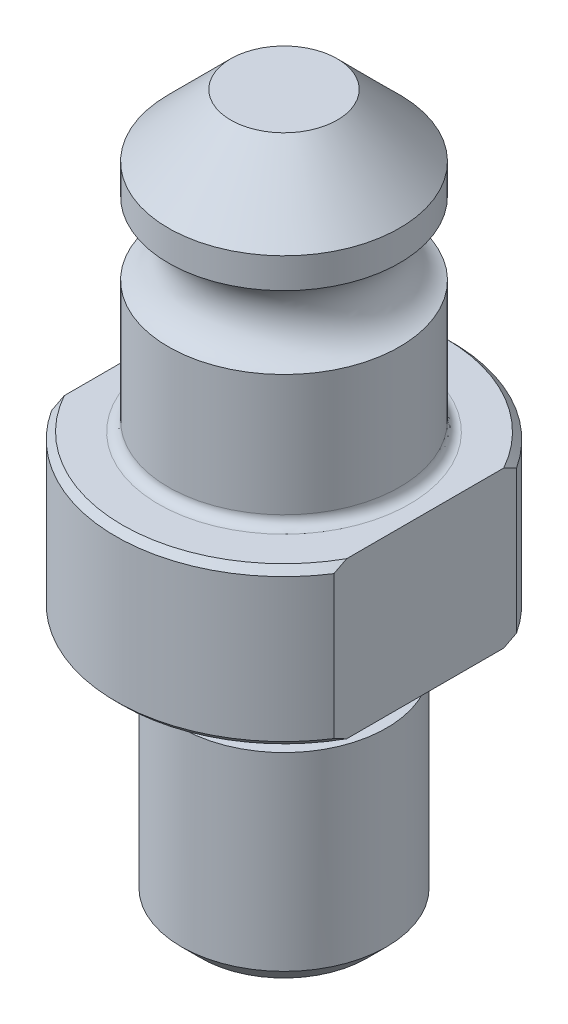
ISO-10303-21;
HEADER;
FILE_DESCRIPTION(('STEP AP214'),'2;1');
FILE_NAME('part.step','',(''),(''),'','','');
FILE_SCHEMA(('AUTOMOTIVE_DESIGN { 1 0 10303 214 1 1 1 1 }'));
ENDSEC;
DATA;
#1=APPLICATION_CONTEXT('core data for automotive mechanical design processes');
#2=APPLICATION_PROTOCOL_DEFINITION('international standard','automotive_design',2000,#1);
#3=PRODUCT_CONTEXT('',#1,'mechanical');
#4=PRODUCT('Part','Part','',(#3));
#5=PRODUCT_RELATED_PRODUCT_CATEGORY('part','',(#4));
#6=PRODUCT_DEFINITION_FORMATION('','',#4);
#7=PRODUCT_DEFINITION_CONTEXT('part definition',#1,'design');
#8=PRODUCT_DEFINITION('design','',#6,#7);
#9=PRODUCT_DEFINITION_SHAPE('','',#8);
#10=(LENGTH_UNIT() NAMED_UNIT(*) SI_UNIT(.MILLI.,.METRE.));
#11=(NAMED_UNIT(*) PLANE_ANGLE_UNIT() SI_UNIT($,.RADIAN.));
#12=(NAMED_UNIT(*) SI_UNIT($,.STERADIAN.) SOLID_ANGLE_UNIT());
#13=UNCERTAINTY_MEASURE_WITH_UNIT(LENGTH_MEASURE(1.E-05),#10,'distance_accuracy_value','');
#14=(GEOMETRIC_REPRESENTATION_CONTEXT(3) GLOBAL_UNCERTAINTY_ASSIGNED_CONTEXT((#13)) GLOBAL_UNIT_ASSIGNED_CONTEXT((#10,
#11,#12)) REPRESENTATION_CONTEXT('',''));
#15=CARTESIAN_POINT('',(0.,0.,0.));
#16=DIRECTION('',(0.,0.,1.));
#17=DIRECTION('',(1.,0.,0.));
#18=AXIS2_PLACEMENT_3D('',#15,#16,#17);
#19=CARTESIAN_POINT('',(0.,-19.9898,0.));
#20=DIRECTION('',(0.,1.,0.));
#21=DIRECTION('',(-1.,0.,0.));
#22=AXIS2_PLACEMENT_3D('',#19,#20,#21);
#23=CYLINDRICAL_SURFACE('',#22,13.0048);
#24=DIRECTION('',(0.,1.,0.));
#25=VECTOR('',#24,1.);
#26=CARTESIAN_POINT('',(-10.922,-19.9898,-7.05937242536474));
#27=LINE('',#26,#25);
#28=CARTESIAN_POINT('',(-10.922,0.508000000000003,-7.05937242536474));
#29=VERTEX_POINT('',#28);
#30=CARTESIAN_POINT('',(-10.922,11.557,-7.05937242536474));
#31=VERTEX_POINT('',#30);
#32=EDGE_CURVE('E180',#29,#31,#27,.T.);
#33=ORIENTED_EDGE('',*,*,#32,.T.);
#34=CARTESIAN_POINT('',(0.,11.557,0.));
#35=DIRECTION('',(0.,1.,0.));
#36=DIRECTION('',(-1.,0.,0.));
#37=AXIS2_PLACEMENT_3D('',#34,#35,#36);
#38=CIRCLE('',#37,13.0048);
#39=CARTESIAN_POINT('',(10.922,11.557,-7.05937242536474));
#40=VERTEX_POINT('',#39);
#41=EDGE_CURVE('E198',#31,#40,#38,.F.);
#42=ORIENTED_EDGE('',*,*,#41,.T.);
#43=DIRECTION('',(0.,1.,0.));
#44=VECTOR('',#43,1.);
#45=CARTESIAN_POINT('',(10.922,-19.9898,-7.05937242536474));
#46=LINE('',#45,#44);
#47=CARTESIAN_POINT('',(10.922,0.508,-7.05937242536474));
#48=VERTEX_POINT('',#47);
#49=EDGE_CURVE('E160',#48,#40,#46,.T.);
#50=ORIENTED_EDGE('',*,*,#49,.F.);
#51=CARTESIAN_POINT('',(0.,0.508000000000002,0.));
#52=DIRECTION('',(0.,-1.,0.));
#53=DIRECTION('',(1.,0.,0.));
#54=AXIS2_PLACEMENT_3D('',#51,#52,#53);
#55=CIRCLE('',#54,13.0048);
#56=EDGE_CURVE('E201',#48,#29,#55,.F.);
#57=ORIENTED_EDGE('',*,*,#56,.T.);
#58=EDGE_LOOP('',(#33,#42,#50,#57));
#59=FACE_BOUND('',#58,.T.);
#60=ADVANCED_FACE('F33',(#59),#23,.T.);
#61=CARTESIAN_POINT('',(0.,0.508000000000002,0.));
#62=DIRECTION('',(0.,1.,0.));
#63=DIRECTION('',(-1.,0.,0.));
#64=AXIS2_PLACEMENT_3D('',#61,#62,#63);
#65=CONICAL_SURFACE('',#64,13.0048,0.785398163397447);
#66=CARTESIAN_POINT('',(-10.922,6.49442778109678,-15.5363009958452));
#67=CARTESIAN_POINT('',(-10.922,6.25605786357288,-15.2448943017069));
#68=CARTESIAN_POINT('',(-10.922,6.01898571070522,-14.9524176622531));
#69=CARTESIAN_POINT('',(-10.922,5.54790831771549,-14.3649728704944));
#70=CARTESIAN_POINT('',(-10.922,5.31390329127838,-14.0700045469248));
#71=CARTESIAN_POINT('',(-10.922,4.84906398820956,-13.4767536435073));
#72=CARTESIAN_POINT('',(-10.922,4.61823587987926,-13.1784662228699));
#73=CARTESIAN_POINT('',(-10.922,4.16079881032948,-12.5786787648837));
#74=CARTESIAN_POINT('',(-10.922,3.93418976427475,-12.2771787923236));
#75=CARTESIAN_POINT('',(-10.922,3.48055977302829,-11.6631806153642));
#76=CARTESIAN_POINT('',(-10.922,3.25366038100092,-11.3505924217952));
#77=CARTESIAN_POINT('',(-10.922,2.80613919368628,-10.7209568928039));
#78=CARTESIAN_POINT('',(-10.922,2.5855172250723,-10.403909680862));
#79=CARTESIAN_POINT('',(-10.922,2.1519938224816,-9.76484407628645));
#80=CARTESIAN_POINT('',(-10.922,1.93908778665226,-9.4428288156584));
#81=CARTESIAN_POINT('',(-10.922,1.52255815748281,-8.79286929949283));
#82=CARTESIAN_POINT('',(-10.922,1.31893378358035,-8.46492554577681));
#83=CARTESIAN_POINT('',(-10.922,0.896895992870764,-7.75832913316276));
#84=CARTESIAN_POINT('',(-10.922,0.680091130906079,-7.37870874842919));
#85=CARTESIAN_POINT('',(-10.922,0.265138473601918,-6.60923410471799));
#86=CARTESIAN_POINT('',(-10.922,0.0669938188554424,-6.2193781371171));
#87=CARTESIAN_POINT('',(-10.922,-0.304348265294031,-5.43014377226458));
#88=CARTESIAN_POINT('',(-10.922,-0.477661564706995,-5.03082046176389));
#89=CARTESIAN_POINT('',(-10.922,-0.793755564305102,-4.22021322948855));
#90=CARTESIAN_POINT('',(-10.922,-0.936548019389148,-3.80893398204539));
#91=CARTESIAN_POINT('',(-10.922,-1.15371898880256,-3.07668800028723));
#92=CARTESIAN_POINT('',(-10.922,-1.23628931589824,-2.75816190696883));
#93=CARTESIAN_POINT('',(-10.922,-1.37620972517414,-2.11557835731013));
#94=CARTESIAN_POINT('',(-10.922,-1.43356339554038,-1.79152169475967));
#95=CARTESIAN_POINT('',(-10.922,-1.52014905712199,-1.1404244253213));
#96=CARTESIAN_POINT('',(-10.922,-1.54944935279947,-0.813393033321166));
#97=CARTESIAN_POINT('',(-10.922,-1.57856240412513,-0.158004525740137));
#98=CARTESIAN_POINT('',(-10.922,-1.57837576792085,0.170352562359525));
#99=CARTESIAN_POINT('',(-10.922,-1.54853138564584,0.82559925924184));
#100=CARTESIAN_POINT('',(-10.922,-1.51888286377725,1.15248929516499));
#101=CARTESIAN_POINT('',(-10.922,-1.43175113027129,1.80250890350211));
#102=CARTESIAN_POINT('',(-10.922,-1.37426549133881,2.125638145472));
#103=CARTESIAN_POINT('',(-10.922,-1.23402484055168,2.76739307139518));
#104=CARTESIAN_POINT('',(-10.922,-1.15118832078852,3.08600070848074));
#105=CARTESIAN_POINT('',(-10.922,-0.963682977098021,3.7166378267814));
#106=CARTESIAN_POINT('',(-10.922,-0.85901443260572,4.02866739213504));
#107=CARTESIAN_POINT('',(-10.922,-0.604089985172451,4.71939465629928));
#108=CARTESIAN_POINT('',(-10.922,-0.448914103837802,5.09626614785799));
#109=CARTESIAN_POINT('',(-10.922,-0.115976310428851,5.83998165973833));
#110=CARTESIAN_POINT('',(-10.922,0.0617967641718488,6.20682061463084));
#111=CARTESIAN_POINT('',(-10.922,0.435522953008059,6.9319256093163));
#112=CARTESIAN_POINT('',(-10.922,0.631509831608779,7.29017411366199));
#113=CARTESIAN_POINT('',(-10.922,1.03763154780177,7.99843085481694));
#114=CARTESIAN_POINT('',(-10.922,1.24776416541656,8.34844037303822));
#115=CARTESIAN_POINT('',(-10.922,1.68060633380922,9.04339974829467));
#116=CARTESIAN_POINT('',(-10.922,1.90338214172821,9.3883081426192));
#117=CARTESIAN_POINT('',(-10.922,2.35815780000678,10.0719816037068));
#118=CARTESIAN_POINT('',(-10.922,2.590157946251,10.4107464728987));
#119=CARTESIAN_POINT('',(-10.922,3.06142629380382,11.082670686936));
#120=CARTESIAN_POINT('',(-10.922,3.3006871362193,11.4158352084094));
#121=CARTESIAN_POINT('',(-10.922,3.78535799876274,12.0776382680261));
#122=CARTESIAN_POINT('',(-10.922,4.03076785782111,12.4062769243726));
#123=CARTESIAN_POINT('',(-10.922,4.45952972126767,12.9711620540861));
#124=CARTESIAN_POINT('',(-10.922,4.6416837798319,13.208320344332));
#125=CARTESIAN_POINT('',(-10.922,5.00840165637021,13.6807964988436));
#126=CARTESIAN_POINT('',(-10.922,5.19296566644971,13.9161142139705));
#127=CARTESIAN_POINT('',(-10.922,5.56264188164978,14.3830996530387));
#128=CARTESIAN_POINT('',(-10.922,5.74773636077344,14.6147814245548));
#129=CARTESIAN_POINT('',(-10.922,6.11975894858737,15.0766316678378));
#130=CARTESIAN_POINT('',(-10.922,6.30668687848617,15.3068002835769));
#131=CARTESIAN_POINT('',(-10.922,6.49442778109678,15.5363009958452));
#132=B_SPLINE_CURVE_WITH_KNOTS('',3,(#66,#67,#68,#69,#70,#71,#72,#73,#74,#75,#76,#77,#78,#79,
#80,#81,#82,#83,#84,#85,#86,#87,#88,#89,#90,#91,#92,#93,#94,#95,#96,#97,#98,#99,#100,#101,#102,
#103,#104,#105,#106,#107,#108,#109,#110,#111,#112,#113,#114,#115,#116,#117,#118,#119,#120,#121,
#122,#123,#124,#125,#126,#127,#128,#129,#130,#131),.UNSPECIFIED.,.F.,.F.,(4,2,2,2,2,2,2,2,2,2,2,
2,2,2,2,2,2,2,2,2,2,2,2,2,2,2,2,2,2,2,2,2,4),(0.,1.12944942265706,2.2589771195692,
3.39045394647354,4.5219079974624,5.68061535350118,6.83929068521954,7.99726320223564,
9.15513815658702,10.4662310278799,11.7775441688446,13.0825238148826,14.3869999474707,
15.3732906072768,16.3594408781059,17.3431839141845,18.3269066612475,19.3103215122215,
20.2938221288293,21.2805187131147,22.2672026691312,23.4889416544808,24.7112865151225,
25.9359443383661,27.1604104145994,28.3920242944055,29.6236777120148,30.8541219745055,
32.0845340399149,32.9816349047841,33.8788077225433,34.7684201463841,35.657946664297),.UNSPECIFIED.);
#133=CARTESIAN_POINT('',(-10.922,0.,-6.07288450738198));
#134=VERTEX_POINT('',#133);
#135=EDGE_CURVE('E181',#29,#134,#132,.T.);
#136=ORIENTED_EDGE('',*,*,#135,.F.);
#137=ORIENTED_EDGE('',*,*,#56,.F.);
#138=CARTESIAN_POINT('',(10.922,6.49442778109678,15.5363009958452));
#139=CARTESIAN_POINT('',(10.922,6.25605786357287,15.2448943017069));
#140=CARTESIAN_POINT('',(10.922,6.01898571070521,14.9524176622531));
#141=CARTESIAN_POINT('',(10.922,5.54790831771549,14.3649728704944));
#142=CARTESIAN_POINT('',(10.922,5.31390329127838,14.0700045469248));
#143=CARTESIAN_POINT('',(10.922,4.84906398820955,13.4767536435073));
#144=CARTESIAN_POINT('',(10.922,4.61823587987926,13.1784662228699));
#145=CARTESIAN_POINT('',(10.922,4.16079881032948,12.5786787648837));
#146=CARTESIAN_POINT('',(10.922,3.93418976427475,12.2771787923236));
#147=CARTESIAN_POINT('',(10.922,3.48055977302829,11.6631806153642));
#148=CARTESIAN_POINT('',(10.922,3.25366038100092,11.3505924217952));
#149=CARTESIAN_POINT('',(10.922,2.80613919368628,10.7209568928039));
#150=CARTESIAN_POINT('',(10.922,2.5855172250723,10.403909680862));
#151=CARTESIAN_POINT('',(10.922,2.1519938224816,9.76484407628645));
#152=CARTESIAN_POINT('',(10.922,1.93908778665225,9.4428288156584));
#153=CARTESIAN_POINT('',(10.922,1.52255815748281,8.79286929949283));
#154=CARTESIAN_POINT('',(10.922,1.31893378358035,8.4649255457768));
#155=CARTESIAN_POINT('',(10.922,0.896895992870761,7.75832913316275));
#156=CARTESIAN_POINT('',(10.922,0.680091130906074,7.37870874842919));
#157=CARTESIAN_POINT('',(10.922,0.265138473601913,6.60923410471798));
#158=CARTESIAN_POINT('',(10.922,0.0669938188554366,6.21937813711709));
#159=CARTESIAN_POINT('',(10.922,-0.304348265294035,5.43014377226457));
#160=CARTESIAN_POINT('',(10.922,-0.477661564706998,5.03082046176388));
#161=CARTESIAN_POINT('',(10.922,-0.793755564305104,4.22021322948854));
#162=CARTESIAN_POINT('',(10.922,-0.936548019389152,3.80893398204538));
#163=CARTESIAN_POINT('',(10.922,-1.15371898880256,3.07668800028723));
#164=CARTESIAN_POINT('',(10.922,-1.23628931589825,2.75816190696883));
#165=CARTESIAN_POINT('',(10.922,-1.37620972517414,2.11557835731012));
#166=CARTESIAN_POINT('',(10.922,-1.43356339554038,1.79152169475967));
#167=CARTESIAN_POINT('',(10.922,-1.52014905712199,1.1404244253213));
#168=CARTESIAN_POINT('',(10.922,-1.54944935279947,0.813393033321166));
#169=CARTESIAN_POINT('',(10.922,-1.57856240412513,0.158004525740137));
#170=CARTESIAN_POINT('',(10.922,-1.57837576792085,-0.170352562359525));
#171=CARTESIAN_POINT('',(10.922,-1.54853138564585,-0.82559925924184));
#172=CARTESIAN_POINT('',(10.922,-1.51888286377726,-1.15248929516499));
#173=CARTESIAN_POINT('',(10.922,-1.43175113027129,-1.80250890350211));
#174=CARTESIAN_POINT('',(10.922,-1.37426549133882,-2.125638145472));
#175=CARTESIAN_POINT('',(10.922,-1.23402484055168,-2.76739307139518));
#176=CARTESIAN_POINT('',(10.922,-1.15118832078852,-3.08600070848074));
#177=CARTESIAN_POINT('',(10.922,-0.963682977098023,-3.7166378267814));
#178=CARTESIAN_POINT('',(10.922,-0.859014432605723,-4.02866739213504));
#179=CARTESIAN_POINT('',(10.922,-0.604089985172455,-4.71939465629927));
#180=CARTESIAN_POINT('',(10.922,-0.448914103837805,-5.09626614785799));
#181=CARTESIAN_POINT('',(10.922,-0.115976310428854,-5.83998165973833));
#182=CARTESIAN_POINT('',(10.922,0.0617967641718452,-6.20682061463084));
#183=CARTESIAN_POINT('',(10.922,0.435522953008055,-6.93192560931629));
#184=CARTESIAN_POINT('',(10.922,0.631509831608776,-7.29017411366198));
#185=CARTESIAN_POINT('',(10.922,1.03763154780177,-7.99843085481694));
#186=CARTESIAN_POINT('',(10.922,1.24776416541656,-8.34844037303822));
#187=CARTESIAN_POINT('',(10.922,1.68060633380921,-9.04339974829467));
#188=CARTESIAN_POINT('',(10.922,1.9033821417282,-9.3883081426192));
#189=CARTESIAN_POINT('',(10.922,2.35815780000678,-10.0719816037068));
#190=CARTESIAN_POINT('',(10.922,2.59015794625099,-10.4107464728987));
#191=CARTESIAN_POINT('',(10.922,3.06142629380382,-11.082670686936));
#192=CARTESIAN_POINT('',(10.922,3.3006871362193,-11.4158352084094));
#193=CARTESIAN_POINT('',(10.922,3.78535799876274,-12.0776382680261));
#194=CARTESIAN_POINT('',(10.922,4.03076785782111,-12.4062769243726));
#195=CARTESIAN_POINT('',(10.922,4.45952972126767,-12.9711620540861));
#196=CARTESIAN_POINT('',(10.922,4.6416837798319,-13.208320344332));
#197=CARTESIAN_POINT('',(10.922,5.00840165637021,-13.6807964988436));
#198=CARTESIAN_POINT('',(10.922,5.19296566644971,-13.9161142139705));
#199=CARTESIAN_POINT('',(10.922,5.56264188164978,-14.3830996530387));
#200=CARTESIAN_POINT('',(10.922,5.74773636077344,-14.6147814245548));
#201=CARTESIAN_POINT('',(10.922,6.11975894858737,-15.0766316678378));
#202=CARTESIAN_POINT('',(10.922,6.30668687848617,-15.3068002835769));
#203=CARTESIAN_POINT('',(10.922,6.49442778109678,-15.5363009958452));
#204=B_SPLINE_CURVE_WITH_KNOTS('',3,(#138,#139,#140,#141,#142,#143,#144,#145,#146,#147,#148,
#149,#150,#151,#152,#153,#154,#155,#156,#157,#158,#159,#160,#161,#162,#163,#164,#165,#166,#167,
#168,#169,#170,#171,#172,#173,#174,#175,#176,#177,#178,#179,#180,#181,#182,#183,#184,#185,#186,
#187,#188,#189,#190,#191,#192,#193,#194,#195,#196,#197,#198,#199,#200,#201,#202,#203),
.UNSPECIFIED.,.F.,.F.,(4,2,2,2,2,2,2,2,2,2,2,2,2,2,2,2,2,2,2,2,2,2,2,2,2,2,2,2,2,2,2,2,4),(0.,
1.12944942265706,2.2589771195692,3.39045394647355,4.5219079974624,5.68061535350118,
6.83929068521954,7.99726320223564,9.15513815658703,10.4662310278799,11.7775441688446,
13.0825238148826,14.3869999474707,15.3732906072768,16.3594408781059,17.3431839141845,
18.3269066612475,19.3103215122215,20.2938221288293,21.2805187131147,22.2672026691312,
23.4889416544808,24.7112865151225,25.9359443383661,27.1604104145994,28.3920242944055,
29.6236777120148,30.8541219745055,32.0845340399149,32.9816349047841,33.8788077225433,
34.7684201463841,35.657946664297),.UNSPECIFIED.);
#205=CARTESIAN_POINT('',(10.922,0.,-6.07288450738198));
#206=VERTEX_POINT('',#205);
#207=EDGE_CURVE('E151',#206,#48,#204,.T.);
#208=ORIENTED_EDGE('',*,*,#207,.F.);
#209=CARTESIAN_POINT('',(0.,0.,0.));
#210=DIRECTION('',(0.,-1.,0.));
#211=DIRECTION('',(1.,0.,0.));
#212=AXIS2_PLACEMENT_3D('',#209,#210,#211);
#213=CIRCLE('',#212,12.4968);
#214=EDGE_CURVE('E118',#134,#206,#213,.T.);
#215=ORIENTED_EDGE('',*,*,#214,.F.);
#216=EDGE_LOOP('',(#136,#137,#208,#215));
#217=FACE_BOUND('',#216,.T.);
#218=ADVANCED_FACE('F168',(#217),#65,.T.);
#219=CARTESIAN_POINT('',(0.,12.065,0.));
#220=DIRECTION('',(0.,-1.,0.));
#221=DIRECTION('',(1.,0.,0.));
#222=AXIS2_PLACEMENT_3D('',#219,#220,#221);
#223=CONICAL_SURFACE('',#222,12.4968,0.78539816339746);
#224=CARTESIAN_POINT('',(-10.922,5.57057221890337,15.5363009958452));
#225=CARTESIAN_POINT('',(-10.922,5.80894213642727,15.2448943017069));
#226=CARTESIAN_POINT('',(-10.922,6.04601428929493,14.9524176622531));
#227=CARTESIAN_POINT('',(-10.922,6.51709168228465,14.3649728704944));
#228=CARTESIAN_POINT('',(-10.922,6.75109670872175,14.0700045469248));
#229=CARTESIAN_POINT('',(-10.922,7.21593601179057,13.4767536435072));
#230=CARTESIAN_POINT('',(-10.922,7.44676412012087,13.1784662228699));
#231=CARTESIAN_POINT('',(-10.922,7.90420118967064,12.5786787648837));
#232=CARTESIAN_POINT('',(-10.922,8.13081023572536,12.2771787923236));
#233=CARTESIAN_POINT('',(-10.922,8.58444022697182,11.6631806153641));
#234=CARTESIAN_POINT('',(-10.922,8.81133961899919,11.3505924217952));
#235=CARTESIAN_POINT('',(-10.922,9.25886080631382,10.7209568928039));
#236=CARTESIAN_POINT('',(-10.922,9.4794827749278,10.4039096808619));
#237=CARTESIAN_POINT('',(-10.922,9.91300617751849,9.76484407628636));
#238=CARTESIAN_POINT('',(-10.922,10.1259122133478,9.44282881565831));
#239=CARTESIAN_POINT('',(-10.922,10.5424418425173,8.79286929949273));
#240=CARTESIAN_POINT('',(-10.922,10.7460662164197,8.46492554577669));
#241=CARTESIAN_POINT('',(-10.922,11.1681040071293,7.75832913316264));
#242=CARTESIAN_POINT('',(-10.922,11.384908869094,7.37870874842906));
#243=CARTESIAN_POINT('',(-10.922,11.7998615263981,6.60923410471785));
#244=CARTESIAN_POINT('',(-10.922,11.9980061811446,6.21937813711696));
#245=CARTESIAN_POINT('',(-10.922,12.3693482652941,5.43014377226443));
#246=CARTESIAN_POINT('',(-10.922,12.542661564707,5.03082046176373));
#247=CARTESIAN_POINT('',(-10.922,12.8587555643051,4.22021322948838));
#248=CARTESIAN_POINT('',(-10.922,13.0015480193892,3.80893398204522));
#249=CARTESIAN_POINT('',(-10.922,13.2187189888026,3.07668800028706));
#250=CARTESIAN_POINT('',(-10.922,13.3012893158982,2.75816190696864));
#251=CARTESIAN_POINT('',(-10.922,13.4412097251741,2.11557835730992));
#252=CARTESIAN_POINT('',(-10.922,13.4985633955403,1.79152169475946));
#253=CARTESIAN_POINT('',(-10.922,13.5851490571219,1.14042442532108));
#254=CARTESIAN_POINT('',(-10.922,13.6144493527994,0.813393033320934));
#255=CARTESIAN_POINT('',(-10.922,13.6435624041251,0.158004525739889));
#256=CARTESIAN_POINT('',(-10.922,13.6433757679208,-0.170352562359779));
#257=CARTESIAN_POINT('',(-10.922,13.6135313856458,-0.825599259242107));
#258=CARTESIAN_POINT('',(-10.922,13.5838828637772,-1.15248929516526));
#259=CARTESIAN_POINT('',(-10.922,13.4967511302712,-1.80250890350239));
#260=CARTESIAN_POINT('',(-10.922,13.4392654913387,-2.12563814547229));
#261=CARTESIAN_POINT('',(-10.922,13.2990248405515,-2.76739307139548));
#262=CARTESIAN_POINT('',(-10.922,13.2161883207884,-3.08600070848105));
#263=CARTESIAN_POINT('',(-10.922,13.0286829770979,-3.71663782678171));
#264=CARTESIAN_POINT('',(-10.922,12.9240144326056,-4.02866739213536));
#265=CARTESIAN_POINT('',(-10.922,12.6690899851723,-4.71939465629964));
#266=CARTESIAN_POINT('',(-10.922,12.5139141038376,-5.09626614785839));
#267=CARTESIAN_POINT('',(-10.922,12.1809763104286,-5.83998165973881));
#268=CARTESIAN_POINT('',(-10.922,12.0032032358279,-6.20682061463136));
#269=CARTESIAN_POINT('',(-10.922,11.6294770469916,-6.93192560931689));
#270=CARTESIAN_POINT('',(-10.922,11.4334901683909,-7.29017411366262));
#271=CARTESIAN_POINT('',(-10.922,11.0273684521978,-7.99843085481764));
#272=CARTESIAN_POINT('',(-10.922,10.817235834583,-8.34844037303897));
#273=CARTESIAN_POINT('',(-10.922,10.3843936661903,-9.04339974829548));
#274=CARTESIAN_POINT('',(-10.922,10.1616178582713,-9.38830814262005));
#275=CARTESIAN_POINT('',(-10.922,9.70684219999263,-10.0719816037077));
#276=CARTESIAN_POINT('',(-10.922,9.47484205374839,-10.4107464728996));
#277=CARTESIAN_POINT('',(-10.922,9.0035737061955,-11.082670686937));
#278=CARTESIAN_POINT('',(-10.922,8.76431286378,-11.4158352084105));
#279=CARTESIAN_POINT('',(-10.922,8.2796420012365,-12.0776382680272));
#280=CARTESIAN_POINT('',(-10.922,8.0342321421781,-12.4062769243738));
#281=CARTESIAN_POINT('',(-10.922,7.60547027873158,-12.9711620540872));
#282=CARTESIAN_POINT('',(-10.922,7.42331622016743,-13.208320344333));
#283=CARTESIAN_POINT('',(-10.922,7.05659834362928,-13.6807964988444));
#284=CARTESIAN_POINT('',(-10.922,6.87203433354987,-13.9161142139712));
#285=CARTESIAN_POINT('',(-10.922,6.50235811834996,-14.3830996530392));
#286=CARTESIAN_POINT('',(-10.922,6.31726363922637,-14.6147814245552));
#287=CARTESIAN_POINT('',(-10.922,5.94524105141261,-15.0766316678379));
#288=CARTESIAN_POINT('',(-10.922,5.7583131215139,-15.306800283577));
#289=CARTESIAN_POINT('',(-10.922,5.57057221890337,-15.5363009958452));
#290=B_SPLINE_CURVE_WITH_KNOTS('',3,(#224,#225,#226,#227,#228,#229,#230,#231,#232,#233,#234,
#235,#236,#237,#238,#239,#240,#241,#242,#243,#244,#245,#246,#247,#248,#249,#250,#251,#252,#253,
#254,#255,#256,#257,#258,#259,#260,#261,#262,#263,#264,#265,#266,#267,#268,#269,#270,#271,#272,
#273,#274,#275,#276,#277,#278,#279,#280,#281,#282,#283,#284,#285,#286,#287,#288,#289),
.UNSPECIFIED.,.F.,.F.,(4,2,2,2,2,2,2,2,2,2,2,2,2,2,2,2,2,2,2,2,2,2,2,2,2,2,2,2,2,2,2,2,4),(0.,
1.12944942265706,2.25897711956921,3.39045394647356,4.52190799746242,5.68061535350121,
6.83929068521957,7.99726320223569,9.15513815658707,10.46623102788,11.7775441688447,
13.0825238148827,14.3869999474708,15.3732906072768,16.359440878106,17.3431839141846,
18.3269066612477,19.3103215122216,20.2938221288294,21.2805187131149,22.2672026691314,
23.4889416544812,24.711286515123,25.9359443383667,27.1604104146002,28.3920242944064,
29.6236777120158,30.8541219745067,32.0845340399162,32.981634904785,33.8788077225438,
34.7684201463843,35.6579466642967),.UNSPECIFIED.);
#291=CARTESIAN_POINT('',(-10.922,11.557,7.05937242536474));
#292=VERTEX_POINT('',#291);
#293=CARTESIAN_POINT('',(-10.922,12.065,6.07288450738193));
#294=VERTEX_POINT('',#293);
#295=EDGE_CURVE('E97',#292,#294,#290,.T.);
#296=ORIENTED_EDGE('',*,*,#295,.F.);
#297=CARTESIAN_POINT('',(10.922,11.557,7.05937242536474));
#298=VERTEX_POINT('',#297);
#299=EDGE_CURVE('E204',#298,#292,#38,.F.);
#300=ORIENTED_EDGE('',*,*,#299,.F.);
#301=CARTESIAN_POINT('',(10.922,5.57057221890337,-15.5363009958452));
#302=CARTESIAN_POINT('',(10.922,5.80894213642727,-15.2448943017069));
#303=CARTESIAN_POINT('',(10.922,6.04601428929493,-14.9524176622531));
#304=CARTESIAN_POINT('',(10.922,6.51709168228465,-14.3649728704944));
#305=CARTESIAN_POINT('',(10.922,6.75109670872176,-14.0700045469248));
#306=CARTESIAN_POINT('',(10.922,7.21593601179058,-13.4767536435072));
#307=CARTESIAN_POINT('',(10.922,7.44676412012087,-13.1784662228699));
#308=CARTESIAN_POINT('',(10.922,7.90420118967065,-12.5786787648837));
#309=CARTESIAN_POINT('',(10.922,8.13081023572537,-12.2771787923236));
#310=CARTESIAN_POINT('',(10.922,8.58444022697182,-11.6631806153641));
#311=CARTESIAN_POINT('',(10.922,8.81133961899919,-11.3505924217952));
#312=CARTESIAN_POINT('',(10.922,9.25886080631382,-10.7209568928039));
#313=CARTESIAN_POINT('',(10.922,9.4794827749278,-10.4039096808619));
#314=CARTESIAN_POINT('',(10.922,9.91300617751849,-9.76484407628636));
#315=CARTESIAN_POINT('',(10.922,10.1259122133478,-9.44282881565831));
#316=CARTESIAN_POINT('',(10.922,10.5424418425173,-8.79286929949273));
#317=CARTESIAN_POINT('',(10.922,10.7460662164197,-8.46492554577669));
#318=CARTESIAN_POINT('',(10.922,11.1681040071293,-7.75832913316264));
#319=CARTESIAN_POINT('',(10.922,11.384908869094,-7.37870874842907));
#320=CARTESIAN_POINT('',(10.922,11.7998615263981,-6.60923410471785));
#321=CARTESIAN_POINT('',(10.922,11.9980061811446,-6.21937813711696));
#322=CARTESIAN_POINT('',(10.922,12.3693482652941,-5.43014377226443));
#323=CARTESIAN_POINT('',(10.922,12.542661564707,-5.03082046176373));
#324=CARTESIAN_POINT('',(10.922,12.8587555643051,-4.22021322948838));
#325=CARTESIAN_POINT('',(10.922,13.0015480193892,-3.80893398204522));
#326=CARTESIAN_POINT('',(10.922,13.2187189888026,-3.07668800028706));
#327=CARTESIAN_POINT('',(10.922,13.3012893158982,-2.75816190696864));
#328=CARTESIAN_POINT('',(10.922,13.4412097251741,-2.11557835730992));
#329=CARTESIAN_POINT('',(10.922,13.4985633955404,-1.79152169475946));
#330=CARTESIAN_POINT('',(10.922,13.5851490571219,-1.14042442532108));
#331=CARTESIAN_POINT('',(10.922,13.6144493527994,-0.813393033320934));
#332=CARTESIAN_POINT('',(10.922,13.6435624041251,-0.15800452573989));
#333=CARTESIAN_POINT('',(10.922,13.6433757679208,0.170352562359778));
#334=CARTESIAN_POINT('',(10.922,13.6135313856458,0.825599259242107));
#335=CARTESIAN_POINT('',(10.922,13.5838828637772,1.15248929516526));
#336=CARTESIAN_POINT('',(10.922,13.4967511302712,1.80250890350239));
#337=CARTESIAN_POINT('',(10.922,13.4392654913387,2.12563814547229));
#338=CARTESIAN_POINT('',(10.922,13.2990248405515,2.76739307139548));
#339=CARTESIAN_POINT('',(10.922,13.2161883207884,3.08600070848105));
#340=CARTESIAN_POINT('',(10.922,13.0286829770979,3.71663782678171));
#341=CARTESIAN_POINT('',(10.922,12.9240144326056,4.02866739213536));
#342=CARTESIAN_POINT('',(10.922,12.6690899851723,4.71939465629963));
#343=CARTESIAN_POINT('',(10.922,12.5139141038376,5.09626614785839));
#344=CARTESIAN_POINT('',(10.922,12.1809763104286,5.83998165973881));
#345=CARTESIAN_POINT('',(10.922,12.0032032358279,6.20682061463135));
#346=CARTESIAN_POINT('',(10.922,11.6294770469916,6.93192560931689));
#347=CARTESIAN_POINT('',(10.922,11.4334901683909,7.29017411366261));
#348=CARTESIAN_POINT('',(10.922,11.0273684521978,7.99843085481764));
#349=CARTESIAN_POINT('',(10.922,10.817235834583,8.34844037303896));
#350=CARTESIAN_POINT('',(10.922,10.3843936661903,9.04339974829548));
#351=CARTESIAN_POINT('',(10.922,10.1616178582713,9.38830814262005));
#352=CARTESIAN_POINT('',(10.922,9.70684219999264,10.0719816037077));
#353=CARTESIAN_POINT('',(10.922,9.47484205374839,10.4107464728996));
#354=CARTESIAN_POINT('',(10.922,9.00357370619551,11.082670686937));
#355=CARTESIAN_POINT('',(10.922,8.76431286378,11.4158352084105));
#356=CARTESIAN_POINT('',(10.922,8.27964200123651,12.0776382680272));
#357=CARTESIAN_POINT('',(10.922,8.03423214217811,12.4062769243738));
#358=CARTESIAN_POINT('',(10.922,7.60547027873159,12.9711620540872));
#359=CARTESIAN_POINT('',(10.922,7.42331622016744,13.208320344333));
#360=CARTESIAN_POINT('',(10.922,7.05659834362929,13.6807964988444));
#361=CARTESIAN_POINT('',(10.922,6.87203433354987,13.9161142139712));
#362=CARTESIAN_POINT('',(10.922,6.50235811834996,14.3830996530392));
#363=CARTESIAN_POINT('',(10.922,6.31726363922638,14.6147814245552));
#364=CARTESIAN_POINT('',(10.922,5.94524105141261,15.0766316678379));
#365=CARTESIAN_POINT('',(10.922,5.7583131215139,15.306800283577));
#366=CARTESIAN_POINT('',(10.922,5.57057221890337,15.5363009958452));
#367=B_SPLINE_CURVE_WITH_KNOTS('',3,(#301,#302,#303,#304,#305,#306,#307,#308,#309,#310,#311,
#312,#313,#314,#315,#316,#317,#318,#319,#320,#321,#322,#323,#324,#325,#326,#327,#328,#329,#330,
#331,#332,#333,#334,#335,#336,#337,#338,#339,#340,#341,#342,#343,#344,#345,#346,#347,#348,#349,
#350,#351,#352,#353,#354,#355,#356,#357,#358,#359,#360,#361,#362,#363,#364,#365,#366),
.UNSPECIFIED.,.F.,.F.,(4,2,2,2,2,2,2,2,2,2,2,2,2,2,2,2,2,2,2,2,2,2,2,2,2,2,2,2,2,2,2,2,4),(0.,
1.12944942265706,2.25897711956921,3.39045394647356,4.52190799746242,5.68061535350121,
6.83929068521957,7.99726320223568,9.15513815658707,10.46623102788,11.7775441688447,
13.0825238148827,14.3869999474708,15.3732906072768,16.359440878106,17.3431839141846,
18.3269066612477,19.3103215122216,20.2938221288294,21.2805187131149,22.2672026691314,
23.4889416544812,24.711286515123,25.9359443383667,27.1604104146002,28.3920242944064,
29.6236777120158,30.8541219745067,32.0845340399162,32.981634904785,33.8788077225438,
34.7684201463843,35.6579466642967),.UNSPECIFIED.);
#368=CARTESIAN_POINT('',(10.922,12.065,6.07288450738193));
#369=VERTEX_POINT('',#368);
#370=EDGE_CURVE('E113',#369,#298,#367,.T.);
#371=ORIENTED_EDGE('',*,*,#370,.F.);
#372=CARTESIAN_POINT('',(0.,12.065,0.));
#373=DIRECTION('',(0.,1.,0.));
#374=DIRECTION('',(-1.,0.,0.));
#375=AXIS2_PLACEMENT_3D('',#372,#373,#374);
#376=CIRCLE('',#375,12.4968);
#377=EDGE_CURVE('E55',#294,#369,#376,.T.);
#378=ORIENTED_EDGE('',*,*,#377,.F.);
#379=EDGE_LOOP('',(#296,#300,#371,#378));
#380=FACE_BOUND('',#379,.T.);
#381=ADVANCED_FACE('F112',(#380),#223,.T.);
#382=CARTESIAN_POINT('',(0.,-19.9898,0.));
#383=DIRECTION('',(0.,-1.,0.));
#384=DIRECTION('',(1.,0.,0.));
#385=AXIS2_PLACEMENT_3D('',#382,#383,#384);
#386=PLANE('',#385);
#387=CARTESIAN_POINT('',(0.,-19.9898,0.));
#388=DIRECTION('',(0.,-1.,0.));
#389=DIRECTION('',(1.,0.,0.));
#390=AXIS2_PLACEMENT_3D('',#387,#388,#389);
#391=CIRCLE('',#390,6.4135);
#392=CARTESIAN_POINT('',(6.4135,-19.9898,0.));
#393=VERTEX_POINT('',#392);
#394=EDGE_CURVE('E124',#393,#393,#391,.T.);
#395=ORIENTED_EDGE('',*,*,#394,.T.);
#396=EDGE_LOOP('',(#395));
#397=FACE_BOUND('',#396,.T.);
#398=ADVANCED_FACE('F169',(#397),#386,.T.);
#399=CARTESIAN_POINT('',(0.,-19.9898,0.));
#400=DIRECTION('',(0.,1.,0.));
#401=DIRECTION('',(-1.,0.,0.));
#402=AXIS2_PLACEMENT_3D('',#399,#400,#401);
#403=CYLINDRICAL_SURFACE('',#402,7.9375);
#404=CARTESIAN_POINT('',(0.,-18.4658,0.));
#405=DIRECTION('',(0.,-1.,0.));
#406=DIRECTION('',(1.,0.,0.));
#407=AXIS2_PLACEMENT_3D('',#404,#405,#406);
#408=CIRCLE('',#407,7.9375);
#409=CARTESIAN_POINT('',(7.9375,-18.4658,0.));
#410=VERTEX_POINT('',#409);
#411=EDGE_CURVE('E116',#410,#410,#408,.F.);
#412=ORIENTED_EDGE('',*,*,#411,.T.);
#413=EDGE_LOOP('',(#412));
#414=FACE_BOUND('',#413,.T.);
#415=CARTESIAN_POINT('',(0.,-3.81,0.));
#416=DIRECTION('',(0.,1.,0.));
#417=DIRECTION('',(-1.,0.,0.));
#418=AXIS2_PLACEMENT_3D('',#415,#416,#417);
#419=CIRCLE('',#418,7.9375);
#420=CARTESIAN_POINT('',(-7.9375,-3.81,0.));
#421=VERTEX_POINT('',#420);
#422=EDGE_CURVE('E207',#421,#421,#419,.T.);
#423=ORIENTED_EDGE('',*,*,#422,.F.);
#424=EDGE_LOOP('',(#423));
#425=FACE_BOUND('',#424,.T.);
#426=ADVANCED_FACE('F263',(#414,#425),#403,.T.);
#427=CARTESIAN_POINT('',(-7.9375,-3.81,0.));
#428=DIRECTION('',(0.,1.,0.));
#429=DIRECTION('',(-1.,0.,0.));
#430=AXIS2_PLACEMENT_3D('',#427,#428,#429);
#431=PLANE('',#430);
#432=ORIENTED_EDGE('',*,*,#422,.T.);
#433=EDGE_LOOP('',(#432));
#434=FACE_BOUND('',#433,.T.);
#435=CARTESIAN_POINT('',(0.,-3.81,0.));
#436=DIRECTION('',(0.,1.,0.));
#437=DIRECTION('',(-1.,0.,0.));
#438=AXIS2_PLACEMENT_3D('',#435,#436,#437);
#439=CIRCLE('',#438,6.223);
#440=CARTESIAN_POINT('',(-6.223,-3.81,0.));
#441=VERTEX_POINT('',#440);
#442=EDGE_CURVE('E210',#441,#441,#439,.T.);
#443=ORIENTED_EDGE('',*,*,#442,.F.);
#444=EDGE_LOOP('',(#443));
#445=FACE_BOUND('',#444,.T.);
#446=ADVANCED_FACE('F278',(#434,#445),#431,.T.);
#447=CARTESIAN_POINT('',(0.,-19.9898,0.));
#448=DIRECTION('',(0.,1.,0.));
#449=DIRECTION('',(-1.,0.,0.));
#450=AXIS2_PLACEMENT_3D('',#447,#448,#449);
#451=CYLINDRICAL_SURFACE('',#450,6.223);
#452=ORIENTED_EDGE('',*,*,#442,.T.);
#453=EDGE_LOOP('',(#452));
#454=FACE_BOUND('',#453,.T.);
#455=CARTESIAN_POINT('',(0.,-1.27,0.));
#456=DIRECTION('',(0.,1.,0.));
#457=DIRECTION('',(-1.,0.,0.));
#458=AXIS2_PLACEMENT_3D('',#455,#456,#457);
#459=CIRCLE('',#458,6.223);
#460=CARTESIAN_POINT('',(-6.223,-1.27,0.));
#461=VERTEX_POINT('',#460);
#462=EDGE_CURVE('E213',#461,#461,#459,.T.);
#463=ORIENTED_EDGE('',*,*,#462,.F.);
#464=EDGE_LOOP('',(#463));
#465=FACE_BOUND('',#464,.T.);
#466=ADVANCED_FACE('F283',(#454,#465),#451,.T.);
#467=CARTESIAN_POINT('',(0.,-1.27,0.));
#468=DIRECTION('',(0.,1.,0.));
#469=DIRECTION('',(-1.,0.,0.));
#470=AXIS2_PLACEMENT_3D('',#467,#468,#469);
#471=TOROIDAL_SURFACE('',#470,7.493,1.27);
#472=ORIENTED_EDGE('',*,*,#462,.T.);
#473=EDGE_LOOP('',(#472));
#474=FACE_BOUND('',#473,.T.);
#475=CARTESIAN_POINT('',(0.,0.,0.));
#476=DIRECTION('',(0.,1.,0.));
#477=DIRECTION('',(-1.,0.,0.));
#478=AXIS2_PLACEMENT_3D('',#475,#476,#477);
#479=CIRCLE('',#478,7.493);
#480=CARTESIAN_POINT('',(-7.493,0.,0.));
#481=VERTEX_POINT('',#480);
#482=EDGE_CURVE('E216',#481,#481,#479,.T.);
#483=ORIENTED_EDGE('',*,*,#482,.F.);
#484=EDGE_LOOP('',(#483));
#485=FACE_BOUND('',#484,.T.);
#486=ADVANCED_FACE('F251',(#474,#485),#471,.F.);
#487=CARTESIAN_POINT('',(-7.493,0.,0.));
#488=DIRECTION('',(0.,-1.,0.));
#489=DIRECTION('',(1.,0.,0.));
#490=AXIS2_PLACEMENT_3D('',#487,#488,#489);
#491=PLANE('',#490);
#492=DIRECTION('',(0.,0.,1.));
#493=VECTOR('',#492,1.);
#494=CARTESIAN_POINT('',(-10.922,0.,0.));
#495=LINE('',#494,#493);
#496=CARTESIAN_POINT('',(-10.922,0.,6.07288450738198));
#497=VERTEX_POINT('',#496);
#498=EDGE_CURVE('E179',#134,#497,#495,.T.);
#499=ORIENTED_EDGE('',*,*,#498,.F.);
#500=ORIENTED_EDGE('',*,*,#214,.T.);
#501=DIRECTION('',(0.,0.,-1.));
#502=VECTOR('',#501,1.);
#503=CARTESIAN_POINT('',(10.922,0.,0.));
#504=LINE('',#503,#502);
#505=CARTESIAN_POINT('',(10.922,0.,6.07288450738198));
#506=VERTEX_POINT('',#505);
#507=EDGE_CURVE('E157',#506,#206,#504,.T.);
#508=ORIENTED_EDGE('',*,*,#507,.F.);
#509=EDGE_CURVE('E114',#506,#497,#213,.T.);
#510=ORIENTED_EDGE('',*,*,#509,.T.);
#511=EDGE_LOOP('',(#499,#500,#508,#510));
#512=FACE_BOUND('',#511,.T.);
#513=ORIENTED_EDGE('',*,*,#482,.T.);
#514=EDGE_LOOP('',(#513));
#515=FACE_BOUND('',#514,.T.);
#516=ADVANCED_FACE('F237',(#512,#515),#491,.T.);
#517=DIRECTION('',(0.,1.,0.));
#518=VECTOR('',#517,1.);
#519=CARTESIAN_POINT('',(-10.922,-19.9898,7.05937242536474));
#520=LINE('',#519,#518);
#521=CARTESIAN_POINT('',(-10.922,0.508000000000003,7.05937242536474));
#522=VERTEX_POINT('',#521);
#523=EDGE_CURVE('E100',#522,#292,#520,.T.);
#524=ORIENTED_EDGE('',*,*,#523,.F.);
#525=CARTESIAN_POINT('',(10.922,0.508,7.05937242536474));
#526=VERTEX_POINT('',#525);
#527=EDGE_CURVE('E203',#522,#526,#55,.F.);
#528=ORIENTED_EDGE('',*,*,#527,.T.);
#529=DIRECTION('',(0.,1.,0.));
#530=VECTOR('',#529,1.);
#531=CARTESIAN_POINT('',(10.922,-19.9898,7.05937242536474));
#532=LINE('',#531,#530);
#533=EDGE_CURVE('E158',#526,#298,#532,.T.);
#534=ORIENTED_EDGE('',*,*,#533,.T.);
#535=ORIENTED_EDGE('',*,*,#299,.T.);
#536=EDGE_LOOP('',(#524,#528,#534,#535));
#537=FACE_BOUND('',#536,.T.);
#538=ADVANCED_FACE('F241',(#537),#23,.T.);
#539=CARTESIAN_POINT('',(-13.0048,12.065,0.));
#540=DIRECTION('',(0.,1.,0.));
#541=DIRECTION('',(-1.,0.,0.));
#542=AXIS2_PLACEMENT_3D('',#539,#540,#541);
#543=PLANE('',#542);
#544=CARTESIAN_POINT('',(0.,12.065,0.));
#545=DIRECTION('',(0.,1.,0.));
#546=DIRECTION('',(-1.,0.,0.));
#547=AXIS2_PLACEMENT_3D('',#544,#545,#546);
#548=CIRCLE('',#547,9.7028);
#549=CARTESIAN_POINT('',(-9.7028,12.065,0.));
#550=VERTEX_POINT('',#549);
#551=EDGE_CURVE('E11',#550,#550,#548,.F.);
#552=ORIENTED_EDGE('',*,*,#551,.T.);
#553=EDGE_LOOP('',(#552));
#554=FACE_BOUND('',#553,.T.);
#555=DIRECTION('',(0.,0.,-1.));
#556=VECTOR('',#555,1.);
#557=CARTESIAN_POINT('',(-10.922,12.065,-7.05937242536474));
#558=LINE('',#557,#556);
#559=CARTESIAN_POINT('',(-10.922,12.065,-6.07288450738193));
#560=VERTEX_POINT('',#559);
#561=EDGE_CURVE('E48',#294,#560,#558,.T.);
#562=ORIENTED_EDGE('',*,*,#561,.F.);
#563=ORIENTED_EDGE('',*,*,#377,.T.);
#564=DIRECTION('',(0.,0.,1.));
#565=VECTOR('',#564,1.);
#566=CARTESIAN_POINT('',(10.922,12.065,-7.05937242536474));
#567=LINE('',#566,#565);
#568=CARTESIAN_POINT('',(10.922,12.065,-6.07288450738194));
#569=VERTEX_POINT('',#568);
#570=EDGE_CURVE('E184',#569,#369,#567,.T.);
#571=ORIENTED_EDGE('',*,*,#570,.F.);
#572=EDGE_CURVE('E109',#569,#560,#376,.T.);
#573=ORIENTED_EDGE('',*,*,#572,.T.);
#574=EDGE_LOOP('',(#562,#563,#571,#573));
#575=FACE_BOUND('',#574,.T.);
#576=ADVANCED_FACE('F107',(#554,#575),#543,.T.);
#577=CARTESIAN_POINT('',(0.,-19.9898,0.));
#578=DIRECTION('',(0.,1.,0.));
#579=DIRECTION('',(-1.,0.,0.));
#580=AXIS2_PLACEMENT_3D('',#577,#578,#579);
#581=CYLINDRICAL_SURFACE('',#580,8.9408);
#582=CARTESIAN_POINT('',(0.,12.827,0.));
#583=DIRECTION('',(0.,1.,0.));
#584=DIRECTION('',(-1.,0.,0.));
#585=AXIS2_PLACEMENT_3D('',#582,#583,#584);
#586=CIRCLE('',#585,8.9408);
#587=CARTESIAN_POINT('',(-8.9408,12.827,0.));
#588=VERTEX_POINT('',#587);
#589=EDGE_CURVE('E41',#588,#588,#586,.T.);
#590=ORIENTED_EDGE('',*,*,#589,.T.);
#591=EDGE_LOOP('',(#590));
#592=FACE_BOUND('',#591,.T.);
#593=CARTESIAN_POINT('',(0.,22.225,0.));
#594=DIRECTION('',(0.,1.,0.));
#595=DIRECTION('',(-1.,0.,0.));
#596=AXIS2_PLACEMENT_3D('',#593,#594,#595);
#597=CIRCLE('',#596,8.9408);
#598=CARTESIAN_POINT('',(-8.9408,22.225,0.));
#599=VERTEX_POINT('',#598);
#600=EDGE_CURVE('E219',#599,#599,#597,.T.);
#601=ORIENTED_EDGE('',*,*,#600,.F.);
#602=EDGE_LOOP('',(#601));
#603=FACE_BOUND('',#602,.T.);
#604=ADVANCED_FACE('F248',(#592,#603),#581,.T.);
#605=CARTESIAN_POINT('',(0.,25.0317,0.));
#606=DIRECTION('',(0.,1.,0.));
#607=DIRECTION('',(-1.,0.,0.));
#608=AXIS2_PLACEMENT_3D('',#605,#606,#607);
#609=TOROIDAL_SURFACE('',#608,9.88171823899372,2.96021823899371);
#610=ORIENTED_EDGE('',*,*,#600,.T.);
#611=EDGE_LOOP('',(#610));
#612=FACE_BOUND('',#611,.T.);
#613=CARTESIAN_POINT('',(0.,27.8384,0.));
#614=DIRECTION('',(0.,1.,0.));
#615=DIRECTION('',(-1.,0.,0.));
#616=AXIS2_PLACEMENT_3D('',#613,#614,#615);
#617=CIRCLE('',#616,8.9408);
#618=CARTESIAN_POINT('',(-8.9408,27.8384,0.));
#619=VERTEX_POINT('',#618);
#620=EDGE_CURVE('E222',#619,#619,#617,.T.);
#621=ORIENTED_EDGE('',*,*,#620,.F.);
#622=EDGE_LOOP('',(#621));
#623=FACE_BOUND('',#622,.T.);
#624=ADVANCED_FACE('F355',(#612,#623),#609,.F.);
#625=CARTESIAN_POINT('',(0.,-19.9898,0.));
#626=DIRECTION('',(0.,1.,0.));
#627=DIRECTION('',(-1.,0.,0.));
#628=AXIS2_PLACEMENT_3D('',#625,#626,#627);
#629=CYLINDRICAL_SURFACE('',#628,8.9408);
#630=ORIENTED_EDGE('',*,*,#620,.T.);
#631=EDGE_LOOP('',(#630));
#632=FACE_BOUND('',#631,.T.);
#633=CARTESIAN_POINT('',(0.,30.1751999999999,0.));
#634=DIRECTION('',(0.,1.,0.));
#635=DIRECTION('',(-1.,0.,0.));
#636=AXIS2_PLACEMENT_3D('',#633,#634,#635);
#637=CIRCLE('',#636,8.9408);
#638=CARTESIAN_POINT('',(-8.9408,30.1751999999999,0.));
#639=VERTEX_POINT('',#638);
#640=EDGE_CURVE('E225',#639,#639,#637,.T.);
#641=ORIENTED_EDGE('',*,*,#640,.F.);
#642=EDGE_LOOP('',(#641));
#643=FACE_BOUND('',#642,.T.);
#644=ADVANCED_FACE('F376',(#632,#643),#629,.T.);
#645=CARTESIAN_POINT('',(0.,35.0012,0.));
#646=DIRECTION('',(0.,-1.,0.));
#647=DIRECTION('',(1.,0.,0.));
#648=AXIS2_PLACEMENT_3D('',#645,#646,#647);
#649=CONICAL_SURFACE('',#648,4.11480000000001,0.785398163397436);
#650=ORIENTED_EDGE('',*,*,#640,.T.);
#651=EDGE_LOOP('',(#650));
#652=FACE_BOUND('',#651,.T.);
#653=CARTESIAN_POINT('',(0.,35.0012,0.));
#654=DIRECTION('',(0.,1.,0.));
#655=DIRECTION('',(-1.,0.,0.));
#656=AXIS2_PLACEMENT_3D('',#653,#654,#655);
#657=CIRCLE('',#656,4.11480000000001);
#658=CARTESIAN_POINT('',(-4.11480000000001,35.0012,0.));
#659=VERTEX_POINT('',#658);
#660=EDGE_CURVE('E227',#659,#659,#657,.T.);
#661=ORIENTED_EDGE('',*,*,#660,.F.);
#662=EDGE_LOOP('',(#661));
#663=FACE_BOUND('',#662,.T.);
#664=ADVANCED_FACE('F382',(#652,#663),#649,.T.);
#665=CARTESIAN_POINT('',(-4.11480000000001,35.0012,0.));
#666=DIRECTION('',(0.,1.,0.));
#667=DIRECTION('',(-1.,0.,0.));
#668=AXIS2_PLACEMENT_3D('',#665,#666,#667);
#669=PLANE('',#668);
#670=ORIENTED_EDGE('',*,*,#660,.T.);
#671=EDGE_LOOP('',(#670));
#672=FACE_BOUND('',#671,.T.);
#673=ADVANCED_FACE('F147',(#672),#669,.T.);
#674=EDGE_CURVE('E173',#497,#522,#132,.T.);
#675=ORIENTED_EDGE('',*,*,#674,.F.);
#676=ORIENTED_EDGE('',*,*,#509,.F.);
#677=EDGE_CURVE('E159',#526,#506,#204,.T.);
#678=ORIENTED_EDGE('',*,*,#677,.F.);
#679=ORIENTED_EDGE('',*,*,#527,.F.);
#680=EDGE_LOOP('',(#675,#676,#678,#679));
#681=FACE_BOUND('',#680,.T.);
#682=ADVANCED_FACE('F163',(#681),#65,.T.);
#683=EDGE_CURVE('E104',#560,#31,#290,.T.);
#684=ORIENTED_EDGE('',*,*,#683,.F.);
#685=ORIENTED_EDGE('',*,*,#572,.F.);
#686=EDGE_CURVE('E132',#40,#569,#367,.T.);
#687=ORIENTED_EDGE('',*,*,#686,.F.);
#688=ORIENTED_EDGE('',*,*,#41,.F.);
#689=EDGE_LOOP('',(#684,#685,#687,#688));
#690=FACE_BOUND('',#689,.T.);
#691=ADVANCED_FACE('F137',(#690),#223,.T.);
#692=CARTESIAN_POINT('',(0.,-18.4658,0.));
#693=DIRECTION('',(0.,1.,0.));
#694=DIRECTION('',(-1.,0.,0.));
#695=AXIS2_PLACEMENT_3D('',#692,#693,#694);
#696=CONICAL_SURFACE('',#695,7.9375,0.785398163397448);
#697=ORIENTED_EDGE('',*,*,#394,.F.);
#698=EDGE_LOOP('',(#697));
#699=FACE_BOUND('',#698,.T.);
#700=ORIENTED_EDGE('',*,*,#411,.F.);
#701=EDGE_LOOP('',(#700));
#702=FACE_BOUND('',#701,.T.);
#703=ADVANCED_FACE('F144',(#699,#702),#696,.T.);
#704=CARTESIAN_POINT('',(10.922,-19.9898,-7.05937242536474));
#705=DIRECTION('',(-1.,0.,0.));
#706=DIRECTION('',(0.,-1.,0.));
#707=AXIS2_PLACEMENT_3D('',#704,#705,#706);
#708=PLANE('',#707);
#709=ORIENTED_EDGE('',*,*,#677,.T.);
#710=ORIENTED_EDGE('',*,*,#507,.T.);
#711=ORIENTED_EDGE('',*,*,#207,.T.);
#712=ORIENTED_EDGE('',*,*,#49,.T.);
#713=ORIENTED_EDGE('',*,*,#686,.T.);
#714=ORIENTED_EDGE('',*,*,#570,.T.);
#715=ORIENTED_EDGE('',*,*,#370,.T.);
#716=ORIENTED_EDGE('',*,*,#533,.F.);
#717=EDGE_LOOP('',(#709,#710,#711,#712,#713,#714,#715,#716));
#718=FACE_BOUND('',#717,.T.);
#719=ADVANCED_FACE('F140',(#718),#708,.F.);
#720=CARTESIAN_POINT('',(-10.922,-19.9898,-7.05937242536474));
#721=DIRECTION('',(1.,0.,0.));
#722=DIRECTION('',(0.,1.,0.));
#723=AXIS2_PLACEMENT_3D('',#720,#721,#722);
#724=PLANE('',#723);
#725=ORIENTED_EDGE('',*,*,#135,.T.);
#726=ORIENTED_EDGE('',*,*,#498,.T.);
#727=ORIENTED_EDGE('',*,*,#674,.T.);
#728=ORIENTED_EDGE('',*,*,#523,.T.);
#729=ORIENTED_EDGE('',*,*,#295,.T.);
#730=ORIENTED_EDGE('',*,*,#561,.T.);
#731=ORIENTED_EDGE('',*,*,#683,.T.);
#732=ORIENTED_EDGE('',*,*,#32,.F.);
#733=EDGE_LOOP('',(#725,#726,#727,#728,#729,#730,#731,#732));
#734=FACE_BOUND('',#733,.T.);
#735=ADVANCED_FACE('F98',(#734),#724,.F.);
#736=CARTESIAN_POINT('',(0.,12.827,0.));
#737=DIRECTION('',(0.,1.,0.));
#738=DIRECTION('',(-1.,0.,0.));
#739=AXIS2_PLACEMENT_3D('',#736,#737,#738);
#740=TOROIDAL_SURFACE('',#739,9.7028,0.762);
#741=ORIENTED_EDGE('',*,*,#551,.F.);
#742=EDGE_LOOP('',(#741));
#743=FACE_BOUND('',#742,.T.);
#744=ORIENTED_EDGE('',*,*,#589,.F.);
#745=EDGE_LOOP('',(#744));
#746=FACE_BOUND('',#745,.T.);
#747=ADVANCED_FACE('F35',(#743,#746),#740,.F.);
#748=CLOSED_SHELL('',(#60,#218,#381,#398,#426,#446,#466,#486,#516,#538,#576,#604,#624,#644,#664,
#673,#682,#691,#703,#719,#735,#747));
#749=MANIFOLD_SOLID_BREP('B2',#748);
#750=ADVANCED_BREP_SHAPE_REPRESENTATION('',(#18,#749),#14);
#751=SHAPE_DEFINITION_REPRESENTATION(#9,#750);
ENDSEC;
END-ISO-10303-21;
